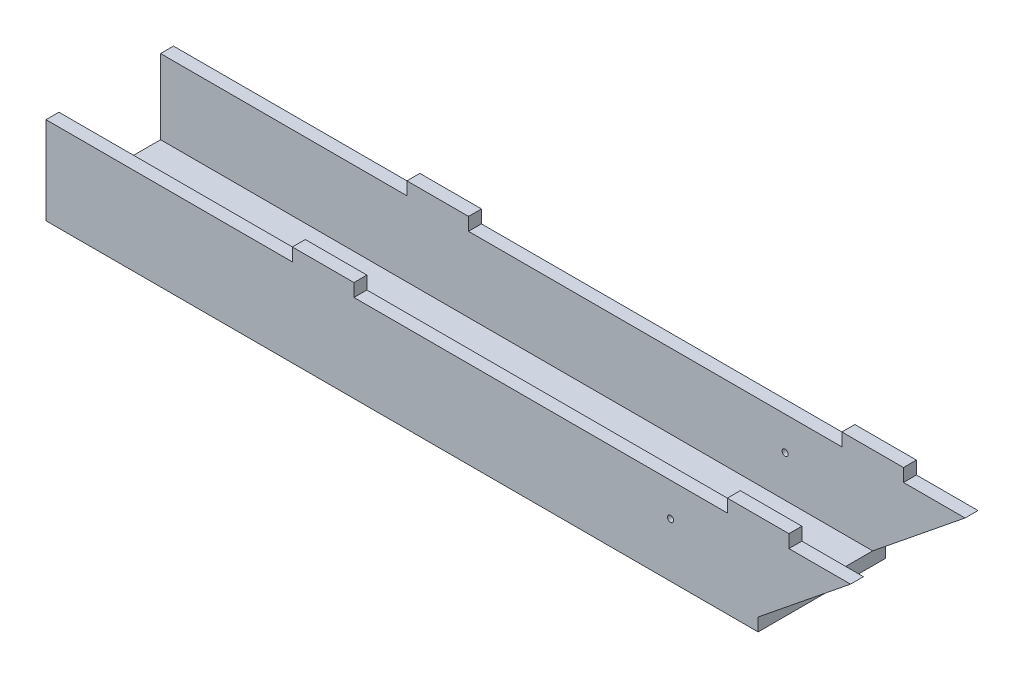
ISO-10303-21;
HEADER;
FILE_DESCRIPTION(('STEP AP214'),'2;1');
FILE_NAME('part.step','',(''),(''),'','','');
FILE_SCHEMA(('AUTOMOTIVE_DESIGN { 1 0 10303 214 1 1 1 1 }'));
ENDSEC;
DATA;
#1=APPLICATION_CONTEXT('core data for automotive mechanical design processes');
#2=APPLICATION_PROTOCOL_DEFINITION('international standard','automotive_design',2000,#1);
#3=PRODUCT_CONTEXT('',#1,'mechanical');
#4=PRODUCT('Part','Part','',(#3));
#5=PRODUCT_RELATED_PRODUCT_CATEGORY('part','',(#4));
#6=PRODUCT_DEFINITION_FORMATION('','',#4);
#7=PRODUCT_DEFINITION_CONTEXT('part definition',#1,'design');
#8=PRODUCT_DEFINITION('design','',#6,#7);
#9=PRODUCT_DEFINITION_SHAPE('','',#8);
#10=(LENGTH_UNIT() NAMED_UNIT(*) SI_UNIT(.MILLI.,.METRE.));
#11=(NAMED_UNIT(*) PLANE_ANGLE_UNIT() SI_UNIT($,.RADIAN.));
#12=(NAMED_UNIT(*) SI_UNIT($,.STERADIAN.) SOLID_ANGLE_UNIT());
#13=UNCERTAINTY_MEASURE_WITH_UNIT(LENGTH_MEASURE(1.E-05),#10,'distance_accuracy_value','');
#14=(GEOMETRIC_REPRESENTATION_CONTEXT(3) GLOBAL_UNCERTAINTY_ASSIGNED_CONTEXT((#13)) GLOBAL_UNIT_ASSIGNED_CONTEXT((#10,
#11,#12)) REPRESENTATION_CONTEXT('',''));
#15=CARTESIAN_POINT('',(0.,0.,0.));
#16=DIRECTION('',(0.,0.,1.));
#17=DIRECTION('',(1.,0.,0.));
#18=AXIS2_PLACEMENT_3D('',#15,#16,#17);
#19=CARTESIAN_POINT('',(0.,5.334,0.));
#20=DIRECTION('',(0.,-1.,0.));
#21=DIRECTION('',(0.,0.,-1.));
#22=AXIS2_PLACEMENT_3D('',#19,#20,#21);
#23=PLANE('',#22);
#24=DIRECTION('',(-1.,0.,0.));
#25=VECTOR('',#24,1.);
#26=CARTESIAN_POINT('',(0.,5.334,-20.955));
#27=LINE('',#26,#25);
#28=CARTESIAN_POINT('',(146.84375,5.334,-20.955));
#29=VERTEX_POINT('',#28);
#30=CARTESIAN_POINT('',(-146.84375,5.334,-20.955));
#31=VERTEX_POINT('',#30);
#32=EDGE_CURVE('E219',#29,#31,#27,.T.);
#33=ORIENTED_EDGE('',*,*,#32,.T.);
#34=DIRECTION('',(0.,0.,1.));
#35=VECTOR('',#34,1.);
#36=CARTESIAN_POINT('',(-146.84375,5.334,26.289));
#37=LINE('',#36,#35);
#38=CARTESIAN_POINT('',(-146.84375,5.334,20.955));
#39=VERTEX_POINT('',#38);
#40=EDGE_CURVE('E207',#31,#39,#37,.T.);
#41=ORIENTED_EDGE('',*,*,#40,.T.);
#42=DIRECTION('',(-1.,0.,0.));
#43=VECTOR('',#42,1.);
#44=CARTESIAN_POINT('',(0.,5.334,20.955));
#45=LINE('',#44,#43);
#46=CARTESIAN_POINT('',(146.84375,5.334,20.955));
#47=VERTEX_POINT('',#46);
#48=EDGE_CURVE('E62',#47,#39,#45,.T.);
#49=ORIENTED_EDGE('',*,*,#48,.F.);
#50=DIRECTION('',(0.,0.,-1.));
#51=VECTOR('',#50,1.);
#52=CARTESIAN_POINT('',(146.84375,5.334,26.289));
#53=LINE('',#52,#51);
#54=EDGE_CURVE('E220',#47,#29,#53,.T.);
#55=ORIENTED_EDGE('',*,*,#54,.T.);
#56=EDGE_LOOP('',(#33,#41,#49,#55));
#57=FACE_BOUND('',#56,.T.);
#58=ADVANCED_FACE('F39',(#57),#23,.F.);
#59=CARTESIAN_POINT('',(146.84375,5.334,26.289));
#60=DIRECTION('',(-1.,0.,0.));
#61=DIRECTION('',(0.,0.,1.));
#62=AXIS2_PLACEMENT_3D('',#59,#60,#61);
#63=PLANE('',#62);
#64=DIRECTION('',(0.,0.,-1.));
#65=VECTOR('',#64,1.);
#66=CARTESIAN_POINT('',(146.84375,0.,26.289));
#67=LINE('',#66,#65);
#68=CARTESIAN_POINT('',(146.84375,0.,26.289));
#69=VERTEX_POINT('',#68);
#70=CARTESIAN_POINT('',(146.84375,0.,-26.289));
#71=VERTEX_POINT('',#70);
#72=EDGE_CURVE('E352',#69,#71,#67,.T.);
#73=ORIENTED_EDGE('',*,*,#72,.T.);
#74=DIRECTION('',(0.,-1.,0.));
#75=VECTOR('',#74,1.);
#76=CARTESIAN_POINT('',(146.84375,5.334,-26.289));
#77=LINE('',#76,#75);
#78=CARTESIAN_POINT('',(146.84375,5.334,-26.289));
#79=VERTEX_POINT('',#78);
#80=EDGE_CURVE('E11',#79,#71,#77,.T.);
#81=ORIENTED_EDGE('',*,*,#80,.F.);
#82=DIRECTION('',(0.,0.,-1.));
#83=VECTOR('',#82,1.);
#84=CARTESIAN_POINT('',(146.84375,5.334,-20.955));
#85=LINE('',#84,#83);
#86=EDGE_CURVE('E55',#29,#79,#85,.T.);
#87=ORIENTED_EDGE('',*,*,#86,.F.);
#88=ORIENTED_EDGE('',*,*,#54,.F.);
#89=CARTESIAN_POINT('',(146.84375,5.334,26.289));
#90=VERTEX_POINT('',#89);
#91=EDGE_CURVE('E216',#90,#47,#53,.T.);
#92=ORIENTED_EDGE('',*,*,#91,.F.);
#93=DIRECTION('',(0.,-1.,0.));
#94=VECTOR('',#93,1.);
#95=CARTESIAN_POINT('',(146.84375,5.334,26.289));
#96=LINE('',#95,#94);
#97=EDGE_CURVE('E215',#90,#69,#96,.T.);
#98=ORIENTED_EDGE('',*,*,#97,.T.);
#99=EDGE_LOOP('',(#73,#81,#87,#88,#92,#98));
#100=FACE_BOUND('',#99,.T.);
#101=ADVANCED_FACE('F41',(#100),#63,.F.);
#102=CARTESIAN_POINT('',(-146.84375,5.334,-26.289));
#103=DIRECTION('',(0.,0.,1.));
#104=DIRECTION('',(1.,0.,0.));
#105=AXIS2_PLACEMENT_3D('',#102,#103,#104);
#106=PLANE('',#105);
#107=CARTESIAN_POINT('',(110.744734300846,22.3424124837105,-26.289));
#108=DIRECTION('',(0.,0.,1.));
#109=DIRECTION('',(1.,0.,0.));
#110=AXIS2_PLACEMENT_3D('',#107,#108,#109);
#111=CIRCLE('',#110,1.26999999999999);
#112=CARTESIAN_POINT('',(112.014734300846,22.3424124837105,-26.289));
#113=VERTEX_POINT('',#112);
#114=EDGE_CURVE('E480',#113,#113,#111,.T.);
#115=ORIENTED_EDGE('',*,*,#114,.T.);
#116=EDGE_LOOP('',(#115));
#117=FACE_BOUND('',#116,.T.);
#118=DIRECTION('',(-1.,0.,0.));
#119=VECTOR('',#118,1.);
#120=CARTESIAN_POINT('',(-146.84375,0.,-26.289));
#121=LINE('',#120,#119);
#122=CARTESIAN_POINT('',(-146.84375,0.,-26.289));
#123=VERTEX_POINT('',#122);
#124=EDGE_CURVE('E378',#71,#123,#121,.T.);
#125=ORIENTED_EDGE('',*,*,#124,.T.);
#126=DIRECTION('',(0.,-1.,0.));
#127=VECTOR('',#126,1.);
#128=CARTESIAN_POINT('',(-146.84375,5.334,-26.289));
#129=LINE('',#128,#127);
#130=CARTESIAN_POINT('',(-146.84375,36.1188,-26.289));
#131=VERTEX_POINT('',#130);
#132=EDGE_CURVE('E48',#131,#123,#129,.T.);
#133=ORIENTED_EDGE('',*,*,#132,.F.);
#134=DIRECTION('',(1.,0.,0.));
#135=VECTOR('',#134,1.);
#136=CARTESIAN_POINT('',(0.,36.1188,-26.289));
#137=LINE('',#136,#135);
#138=CARTESIAN_POINT('',(-45.24375,36.1188,-26.289));
#139=VERTEX_POINT('',#138);
#140=EDGE_CURVE('E255',#131,#139,#137,.T.);
#141=ORIENTED_EDGE('',*,*,#140,.T.);
#142=DIRECTION('',(0.,1.,0.));
#143=VECTOR('',#142,1.);
#144=CARTESIAN_POINT('',(-45.24375,0.,-26.289));
#145=LINE('',#144,#143);
#146=CARTESIAN_POINT('',(-45.24375,41.4528,-26.289));
#147=VERTEX_POINT('',#146);
#148=EDGE_CURVE('E259',#139,#147,#145,.T.);
#149=ORIENTED_EDGE('',*,*,#148,.T.);
#150=DIRECTION('',(1.,0.,0.));
#151=VECTOR('',#150,1.);
#152=CARTESIAN_POINT('',(0.,41.4528,-26.289));
#153=LINE('',#152,#151);
#154=CARTESIAN_POINT('',(-19.84375,41.4528,-26.289));
#155=VERTEX_POINT('',#154);
#156=EDGE_CURVE('E264',#147,#155,#153,.T.);
#157=ORIENTED_EDGE('',*,*,#156,.T.);
#158=DIRECTION('',(0.,1.,0.));
#159=VECTOR('',#158,1.);
#160=CARTESIAN_POINT('',(-19.84375,0.,-26.289));
#161=LINE('',#160,#159);
#162=CARTESIAN_POINT('',(-19.84375,36.1188,-26.289));
#163=VERTEX_POINT('',#162);
#164=EDGE_CURVE('E267',#163,#155,#161,.T.);
#165=ORIENTED_EDGE('',*,*,#164,.F.);
#166=CARTESIAN_POINT('',(134.14375,36.1188,-26.289));
#167=VERTEX_POINT('',#166);
#168=EDGE_CURVE('E261',#163,#167,#137,.T.);
#169=ORIENTED_EDGE('',*,*,#168,.T.);
#170=DIRECTION('',(0.,1.,0.));
#171=VECTOR('',#170,1.);
#172=CARTESIAN_POINT('',(134.14375,0.,-26.289));
#173=LINE('',#172,#171);
#174=CARTESIAN_POINT('',(134.14375,41.4528,-26.289));
#175=VERTEX_POINT('',#174);
#176=EDGE_CURVE('E270',#167,#175,#173,.T.);
#177=ORIENTED_EDGE('',*,*,#176,.T.);
#178=DIRECTION('',(-1.,0.,0.));
#179=VECTOR('',#178,1.);
#180=CARTESIAN_POINT('',(0.,41.4528,-26.289));
#181=LINE('',#180,#179);
#182=CARTESIAN_POINT('',(159.54375,41.4528,-26.289));
#183=VERTEX_POINT('',#182);
#184=EDGE_CURVE('E273',#183,#175,#181,.T.);
#185=ORIENTED_EDGE('',*,*,#184,.F.);
#186=DIRECTION('',(0.,1.,0.));
#187=VECTOR('',#186,1.);
#188=CARTESIAN_POINT('',(159.54375,0.,-26.289));
#189=LINE('',#188,#187);
#190=CARTESIAN_POINT('',(159.54375,36.1188,-26.289));
#191=VERTEX_POINT('',#190);
#192=EDGE_CURVE('E276',#191,#183,#189,.T.);
#193=ORIENTED_EDGE('',*,*,#192,.F.);
#194=CARTESIAN_POINT('',(184.94375,36.1188,-26.289));
#195=VERTEX_POINT('',#194);
#196=EDGE_CURVE('E260',#191,#195,#137,.T.);
#197=ORIENTED_EDGE('',*,*,#196,.T.);
#198=DIRECTION('',(-0.777824179735148,-0.628481937225999,0.));
#199=VECTOR('',#198,1.);
#200=CARTESIAN_POINT('',(55.3942284422675,-68.5572134186479,-26.289));
#201=LINE('',#200,#199);
#202=EDGE_CURVE('E252',#195,#79,#201,.T.);
#203=ORIENTED_EDGE('',*,*,#202,.T.);
#204=ORIENTED_EDGE('',*,*,#80,.T.);
#205=EDGE_LOOP('',(#125,#133,#141,#149,#157,#165,#169,#177,#185,#193,#197,#203,#204));
#206=FACE_BOUND('',#205,.T.);
#207=ADVANCED_FACE('F465',(#117,#206),#106,.F.);
#208=CARTESIAN_POINT('',(-146.84375,5.334,26.289));
#209=DIRECTION('',(1.,0.,0.));
#210=DIRECTION('',(0.,0.,-1.));
#211=AXIS2_PLACEMENT_3D('',#208,#209,#210);
#212=PLANE('',#211);
#213=DIRECTION('',(0.,0.,1.));
#214=VECTOR('',#213,1.);
#215=CARTESIAN_POINT('',(-146.84375,0.,26.289));
#216=LINE('',#215,#214);
#217=CARTESIAN_POINT('',(-146.84375,0.,26.289));
#218=VERTEX_POINT('',#217);
#219=EDGE_CURVE('E380',#123,#218,#216,.T.);
#220=ORIENTED_EDGE('',*,*,#219,.T.);
#221=DIRECTION('',(0.,-1.,0.));
#222=VECTOR('',#221,1.);
#223=CARTESIAN_POINT('',(-146.84375,5.334,26.289));
#224=LINE('',#223,#222);
#225=CARTESIAN_POINT('',(-146.84375,36.1188,26.289));
#226=VERTEX_POINT('',#225);
#227=EDGE_CURVE('E386',#226,#218,#224,.T.);
#228=ORIENTED_EDGE('',*,*,#227,.F.);
#229=DIRECTION('',(0.,0.,1.));
#230=VECTOR('',#229,1.);
#231=CARTESIAN_POINT('',(-146.84375,36.1188,20.955));
#232=LINE('',#231,#230);
#233=CARTESIAN_POINT('',(-146.84375,36.1188,20.955));
#234=VERTEX_POINT('',#233);
#235=EDGE_CURVE('E349',#234,#226,#232,.T.);
#236=ORIENTED_EDGE('',*,*,#235,.F.);
#237=DIRECTION('',(0.,1.,0.));
#238=VECTOR('',#237,1.);
#239=CARTESIAN_POINT('',(-146.84375,0.,20.955));
#240=LINE('',#239,#238);
#241=EDGE_CURVE('E214',#39,#234,#240,.T.);
#242=ORIENTED_EDGE('',*,*,#241,.F.);
#243=ORIENTED_EDGE('',*,*,#40,.F.);
#244=DIRECTION('',(0.,1.,0.));
#245=VECTOR('',#244,1.);
#246=CARTESIAN_POINT('',(-146.84375,0.,-20.955));
#247=LINE('',#246,#245);
#248=CARTESIAN_POINT('',(-146.84375,36.1188,-20.955));
#249=VERTEX_POINT('',#248);
#250=EDGE_CURVE('E212',#31,#249,#247,.T.);
#251=ORIENTED_EDGE('',*,*,#250,.T.);
#252=DIRECTION('',(0.,0.,-1.));
#253=VECTOR('',#252,1.);
#254=CARTESIAN_POINT('',(-146.84375,36.1188,-20.955));
#255=LINE('',#254,#253);
#256=EDGE_CURVE('E298',#249,#131,#255,.T.);
#257=ORIENTED_EDGE('',*,*,#256,.T.);
#258=ORIENTED_EDGE('',*,*,#132,.T.);
#259=EDGE_LOOP('',(#220,#228,#236,#242,#243,#251,#257,#258));
#260=FACE_BOUND('',#259,.T.);
#261=ADVANCED_FACE('F209',(#260),#212,.F.);
#262=CARTESIAN_POINT('',(-146.84375,5.334,26.289));
#263=DIRECTION('',(0.,0.,-1.));
#264=DIRECTION('',(-1.,0.,0.));
#265=AXIS2_PLACEMENT_3D('',#262,#263,#264);
#266=PLANE('',#265);
#267=CARTESIAN_POINT('',(110.744734300846,22.3424124837105,26.289));
#268=DIRECTION('',(0.,0.,1.));
#269=DIRECTION('',(1.,0.,0.));
#270=AXIS2_PLACEMENT_3D('',#267,#268,#269);
#271=CIRCLE('',#270,1.26999999999999);
#272=CARTESIAN_POINT('',(112.014734300846,22.3424124837105,26.289));
#273=VERTEX_POINT('',#272);
#274=EDGE_CURVE('E489',#273,#273,#271,.T.);
#275=ORIENTED_EDGE('',*,*,#274,.F.);
#276=EDGE_LOOP('',(#275));
#277=FACE_BOUND('',#276,.T.);
#278=DIRECTION('',(1.,0.,0.));
#279=VECTOR('',#278,1.);
#280=CARTESIAN_POINT('',(-146.84375,0.,26.289));
#281=LINE('',#280,#279);
#282=EDGE_CURVE('E382',#218,#69,#281,.T.);
#283=ORIENTED_EDGE('',*,*,#282,.T.);
#284=ORIENTED_EDGE('',*,*,#97,.F.);
#285=DIRECTION('',(-0.777824179735148,-0.628481937225999,0.));
#286=VECTOR('',#285,1.);
#287=CARTESIAN_POINT('',(55.3942284422675,-68.5572134186479,26.289));
#288=LINE('',#287,#286);
#289=CARTESIAN_POINT('',(184.94375,36.1188,26.289));
#290=VERTEX_POINT('',#289);
#291=EDGE_CURVE('E280',#290,#90,#288,.T.);
#292=ORIENTED_EDGE('',*,*,#291,.F.);
#293=DIRECTION('',(1.,0.,0.));
#294=VECTOR('',#293,1.);
#295=CARTESIAN_POINT('',(0.,36.1188,26.289));
#296=LINE('',#295,#294);
#297=CARTESIAN_POINT('',(159.54375,36.1188,26.289));
#298=VERTEX_POINT('',#297);
#299=EDGE_CURVE('E329',#298,#290,#296,.T.);
#300=ORIENTED_EDGE('',*,*,#299,.F.);
#301=DIRECTION('',(0.,1.,0.));
#302=VECTOR('',#301,1.);
#303=CARTESIAN_POINT('',(159.54375,0.,26.289));
#304=LINE('',#303,#302);
#305=CARTESIAN_POINT('',(159.54375,41.4528,26.289));
#306=VERTEX_POINT('',#305);
#307=EDGE_CURVE('E331',#298,#306,#304,.T.);
#308=ORIENTED_EDGE('',*,*,#307,.T.);
#309=DIRECTION('',(-1.,0.,0.));
#310=VECTOR('',#309,1.);
#311=CARTESIAN_POINT('',(0.,41.4528,26.289));
#312=LINE('',#311,#310);
#313=CARTESIAN_POINT('',(134.14375,41.4528,26.289));
#314=VERTEX_POINT('',#313);
#315=EDGE_CURVE('E335',#306,#314,#312,.T.);
#316=ORIENTED_EDGE('',*,*,#315,.T.);
#317=DIRECTION('',(0.,1.,0.));
#318=VECTOR('',#317,1.);
#319=CARTESIAN_POINT('',(134.14375,0.,26.289));
#320=LINE('',#319,#318);
#321=CARTESIAN_POINT('',(134.14375,36.1188,26.289));
#322=VERTEX_POINT('',#321);
#323=EDGE_CURVE('E338',#322,#314,#320,.T.);
#324=ORIENTED_EDGE('',*,*,#323,.F.);
#325=CARTESIAN_POINT('',(-19.84375,36.1188,26.289));
#326=VERTEX_POINT('',#325);
#327=EDGE_CURVE('E332',#326,#322,#296,.T.);
#328=ORIENTED_EDGE('',*,*,#327,.F.);
#329=DIRECTION('',(0.,1.,0.));
#330=VECTOR('',#329,1.);
#331=CARTESIAN_POINT('',(-19.84375,0.,26.289));
#332=LINE('',#331,#330);
#333=CARTESIAN_POINT('',(-19.84375,41.4528,26.289));
#334=VERTEX_POINT('',#333);
#335=EDGE_CURVE('E341',#326,#334,#332,.T.);
#336=ORIENTED_EDGE('',*,*,#335,.T.);
#337=DIRECTION('',(1.,0.,0.));
#338=VECTOR('',#337,1.);
#339=CARTESIAN_POINT('',(0.,41.4528,26.289));
#340=LINE('',#339,#338);
#341=CARTESIAN_POINT('',(-45.24375,41.4528,26.289));
#342=VERTEX_POINT('',#341);
#343=EDGE_CURVE('E344',#342,#334,#340,.T.);
#344=ORIENTED_EDGE('',*,*,#343,.F.);
#345=DIRECTION('',(0.,1.,0.));
#346=VECTOR('',#345,1.);
#347=CARTESIAN_POINT('',(-45.24375,0.,26.289));
#348=LINE('',#347,#346);
#349=CARTESIAN_POINT('',(-45.24375,36.1188,26.289));
#350=VERTEX_POINT('',#349);
#351=EDGE_CURVE('E347',#350,#342,#348,.T.);
#352=ORIENTED_EDGE('',*,*,#351,.F.);
#353=EDGE_CURVE('E305',#226,#350,#296,.T.);
#354=ORIENTED_EDGE('',*,*,#353,.F.);
#355=ORIENTED_EDGE('',*,*,#227,.T.);
#356=EDGE_LOOP('',(#283,#284,#292,#300,#308,#316,#324,#328,#336,#344,#352,#354,#355));
#357=FACE_BOUND('',#356,.T.);
#358=ADVANCED_FACE('F398',(#277,#357),#266,.F.);
#359=CARTESIAN_POINT('',(0.,0.,0.));
#360=DIRECTION('',(0.,-1.,0.));
#361=DIRECTION('',(0.,0.,-1.));
#362=AXIS2_PLACEMENT_3D('',#359,#360,#361);
#363=PLANE('',#362);
#364=ORIENTED_EDGE('',*,*,#72,.F.);
#365=ORIENTED_EDGE('',*,*,#282,.F.);
#366=ORIENTED_EDGE('',*,*,#219,.F.);
#367=ORIENTED_EDGE('',*,*,#124,.F.);
#368=EDGE_LOOP('',(#364,#365,#366,#367));
#369=FACE_BOUND('',#368,.T.);
#370=ADVANCED_FACE('F396',(#369),#363,.T.);
#371=CARTESIAN_POINT('',(55.3942284422675,-68.5572134186479,20.955));
#372=DIRECTION('',(-0.628481937225999,0.777824179735148,0.));
#373=DIRECTION('',(-0.777824179735148,-0.628481937225999,0.));
#374=AXIS2_PLACEMENT_3D('',#371,#372,#373);
#375=PLANE('',#374);
#376=ORIENTED_EDGE('',*,*,#291,.T.);
#377=ORIENTED_EDGE('',*,*,#91,.T.);
#378=DIRECTION('',(-0.777824179735148,-0.628481937225999,0.));
#379=VECTOR('',#378,1.);
#380=CARTESIAN_POINT('',(55.3942284422675,-68.5572134186479,20.955));
#381=LINE('',#380,#379);
#382=CARTESIAN_POINT('',(184.94375,36.1188,20.955));
#383=VERTEX_POINT('',#382);
#384=EDGE_CURVE('E301',#383,#47,#381,.T.);
#385=ORIENTED_EDGE('',*,*,#384,.F.);
#386=DIRECTION('',(0.,0.,1.));
#387=VECTOR('',#386,1.);
#388=CARTESIAN_POINT('',(184.94375,36.1188,20.955));
#389=LINE('',#388,#387);
#390=EDGE_CURVE('E326',#383,#290,#389,.T.);
#391=ORIENTED_EDGE('',*,*,#390,.T.);
#392=EDGE_LOOP('',(#376,#377,#385,#391));
#393=FACE_BOUND('',#392,.T.);
#394=ADVANCED_FACE('F404',(#393),#375,.F.);
#395=CARTESIAN_POINT('',(0.,36.1188,20.955));
#396=DIRECTION('',(0.,-1.,0.));
#397=DIRECTION('',(0.,0.,-1.));
#398=AXIS2_PLACEMENT_3D('',#395,#396,#397);
#399=PLANE('',#398);
#400=ORIENTED_EDGE('',*,*,#353,.T.);
#401=DIRECTION('',(0.,0.,1.));
#402=VECTOR('',#401,1.);
#403=CARTESIAN_POINT('',(-45.24375,36.1188,20.955));
#404=LINE('',#403,#402);
#405=CARTESIAN_POINT('',(-45.24375,36.1188,20.955));
#406=VERTEX_POINT('',#405);
#407=EDGE_CURVE('E353',#406,#350,#404,.T.);
#408=ORIENTED_EDGE('',*,*,#407,.F.);
#409=DIRECTION('',(1.,0.,0.));
#410=VECTOR('',#409,1.);
#411=CARTESIAN_POINT('',(0.,36.1188,20.955));
#412=LINE('',#411,#410);
#413=EDGE_CURVE('E308',#234,#406,#412,.T.);
#414=ORIENTED_EDGE('',*,*,#413,.F.);
#415=ORIENTED_EDGE('',*,*,#235,.T.);
#416=EDGE_LOOP('',(#400,#408,#414,#415));
#417=FACE_BOUND('',#416,.T.);
#418=ADVANCED_FACE('F431',(#417),#399,.F.);
#419=CARTESIAN_POINT('',(-45.24375,0.,20.955));
#420=DIRECTION('',(1.,0.,0.));
#421=DIRECTION('',(0.,0.,-1.));
#422=AXIS2_PLACEMENT_3D('',#419,#420,#421);
#423=PLANE('',#422);
#424=ORIENTED_EDGE('',*,*,#351,.T.);
#425=DIRECTION('',(0.,0.,1.));
#426=VECTOR('',#425,1.);
#427=CARTESIAN_POINT('',(-45.24375,41.4528,20.955));
#428=LINE('',#427,#426);
#429=CARTESIAN_POINT('',(-45.24375,41.4528,20.955));
#430=VERTEX_POINT('',#429);
#431=EDGE_CURVE('E356',#430,#342,#428,.T.);
#432=ORIENTED_EDGE('',*,*,#431,.F.);
#433=DIRECTION('',(0.,1.,0.));
#434=VECTOR('',#433,1.);
#435=CARTESIAN_POINT('',(-45.24375,0.,20.955));
#436=LINE('',#435,#434);
#437=EDGE_CURVE('E322',#406,#430,#436,.T.);
#438=ORIENTED_EDGE('',*,*,#437,.F.);
#439=ORIENTED_EDGE('',*,*,#407,.T.);
#440=EDGE_LOOP('',(#424,#432,#438,#439));
#441=FACE_BOUND('',#440,.T.);
#442=ADVANCED_FACE('F436',(#441),#423,.F.);
#443=CARTESIAN_POINT('',(0.,41.4528,20.955));
#444=DIRECTION('',(0.,-1.,0.));
#445=DIRECTION('',(0.,0.,-1.));
#446=AXIS2_PLACEMENT_3D('',#443,#444,#445);
#447=PLANE('',#446);
#448=ORIENTED_EDGE('',*,*,#343,.T.);
#449=DIRECTION('',(0.,0.,1.));
#450=VECTOR('',#449,1.);
#451=CARTESIAN_POINT('',(-19.84375,41.4528,20.955));
#452=LINE('',#451,#450);
#453=CARTESIAN_POINT('',(-19.84375,41.4528,20.955));
#454=VERTEX_POINT('',#453);
#455=EDGE_CURVE('E359',#454,#334,#452,.T.);
#456=ORIENTED_EDGE('',*,*,#455,.F.);
#457=DIRECTION('',(1.,0.,0.));
#458=VECTOR('',#457,1.);
#459=CARTESIAN_POINT('',(0.,41.4528,20.955));
#460=LINE('',#459,#458);
#461=EDGE_CURVE('E320',#430,#454,#460,.T.);
#462=ORIENTED_EDGE('',*,*,#461,.F.);
#463=ORIENTED_EDGE('',*,*,#431,.T.);
#464=EDGE_LOOP('',(#448,#456,#462,#463));
#465=FACE_BOUND('',#464,.T.);
#466=ADVANCED_FACE('F441',(#465),#447,.F.);
#467=CARTESIAN_POINT('',(-19.84375,0.,20.955));
#468=DIRECTION('',(1.,0.,0.));
#469=DIRECTION('',(0.,0.,-1.));
#470=AXIS2_PLACEMENT_3D('',#467,#468,#469);
#471=PLANE('',#470);
#472=ORIENTED_EDGE('',*,*,#335,.F.);
#473=DIRECTION('',(0.,0.,1.));
#474=VECTOR('',#473,1.);
#475=CARTESIAN_POINT('',(-19.84375,36.1188,20.955));
#476=LINE('',#475,#474);
#477=CARTESIAN_POINT('',(-19.84375,36.1188,20.955));
#478=VERTEX_POINT('',#477);
#479=EDGE_CURVE('E361',#478,#326,#476,.T.);
#480=ORIENTED_EDGE('',*,*,#479,.F.);
#481=DIRECTION('',(0.,1.,0.));
#482=VECTOR('',#481,1.);
#483=CARTESIAN_POINT('',(-19.84375,0.,20.955));
#484=LINE('',#483,#482);
#485=EDGE_CURVE('E317',#478,#454,#484,.T.);
#486=ORIENTED_EDGE('',*,*,#485,.T.);
#487=ORIENTED_EDGE('',*,*,#455,.T.);
#488=EDGE_LOOP('',(#472,#480,#486,#487));
#489=FACE_BOUND('',#488,.T.);
#490=ADVANCED_FACE('F458',(#489),#471,.T.);
#491=ORIENTED_EDGE('',*,*,#327,.T.);
#492=DIRECTION('',(0.,0.,1.));
#493=VECTOR('',#492,1.);
#494=CARTESIAN_POINT('',(134.14375,36.1188,20.955));
#495=LINE('',#494,#493);
#496=CARTESIAN_POINT('',(134.14375,36.1188,20.955));
#497=VERTEX_POINT('',#496);
#498=EDGE_CURVE('E363',#497,#322,#495,.T.);
#499=ORIENTED_EDGE('',*,*,#498,.F.);
#500=EDGE_CURVE('E309',#478,#497,#412,.T.);
#501=ORIENTED_EDGE('',*,*,#500,.F.);
#502=ORIENTED_EDGE('',*,*,#479,.T.);
#503=EDGE_LOOP('',(#491,#499,#501,#502));
#504=FACE_BOUND('',#503,.T.);
#505=ADVANCED_FACE('F427',(#504),#399,.F.);
#506=CARTESIAN_POINT('',(134.14375,0.,20.955));
#507=DIRECTION('',(1.,0.,0.));
#508=DIRECTION('',(0.,0.,-1.));
#509=AXIS2_PLACEMENT_3D('',#506,#507,#508);
#510=PLANE('',#509);
#511=ORIENTED_EDGE('',*,*,#323,.T.);
#512=DIRECTION('',(0.,0.,1.));
#513=VECTOR('',#512,1.);
#514=CARTESIAN_POINT('',(134.14375,41.4528,20.955));
#515=LINE('',#514,#513);
#516=CARTESIAN_POINT('',(134.14375,41.4528,20.955));
#517=VERTEX_POINT('',#516);
#518=EDGE_CURVE('E366',#517,#314,#515,.T.);
#519=ORIENTED_EDGE('',*,*,#518,.F.);
#520=DIRECTION('',(0.,1.,0.));
#521=VECTOR('',#520,1.);
#522=CARTESIAN_POINT('',(134.14375,0.,20.955));
#523=LINE('',#522,#521);
#524=EDGE_CURVE('E315',#497,#517,#523,.T.);
#525=ORIENTED_EDGE('',*,*,#524,.F.);
#526=ORIENTED_EDGE('',*,*,#498,.T.);
#527=EDGE_LOOP('',(#511,#519,#525,#526));
#528=FACE_BOUND('',#527,.T.);
#529=ADVANCED_FACE('F422',(#528),#510,.F.);
#530=CARTESIAN_POINT('',(0.,41.4528,20.955));
#531=DIRECTION('',(0.,1.,0.));
#532=DIRECTION('',(0.,0.,1.));
#533=AXIS2_PLACEMENT_3D('',#530,#531,#532);
#534=PLANE('',#533);
#535=ORIENTED_EDGE('',*,*,#315,.F.);
#536=DIRECTION('',(0.,0.,1.));
#537=VECTOR('',#536,1.);
#538=CARTESIAN_POINT('',(159.54375,41.4528,20.955));
#539=LINE('',#538,#537);
#540=CARTESIAN_POINT('',(159.54375,41.4528,20.955));
#541=VERTEX_POINT('',#540);
#542=EDGE_CURVE('E368',#541,#306,#539,.T.);
#543=ORIENTED_EDGE('',*,*,#542,.F.);
#544=DIRECTION('',(-1.,0.,0.));
#545=VECTOR('',#544,1.);
#546=CARTESIAN_POINT('',(0.,41.4528,20.955));
#547=LINE('',#546,#545);
#548=EDGE_CURVE('E312',#541,#517,#547,.T.);
#549=ORIENTED_EDGE('',*,*,#548,.T.);
#550=ORIENTED_EDGE('',*,*,#518,.T.);
#551=EDGE_LOOP('',(#535,#543,#549,#550));
#552=FACE_BOUND('',#551,.T.);
#553=ADVANCED_FACE('F416',(#552),#534,.T.);
#554=CARTESIAN_POINT('',(159.54375,0.,20.955));
#555=DIRECTION('',(1.,0.,0.));
#556=DIRECTION('',(0.,0.,-1.));
#557=AXIS2_PLACEMENT_3D('',#554,#555,#556);
#558=PLANE('',#557);
#559=ORIENTED_EDGE('',*,*,#307,.F.);
#560=DIRECTION('',(0.,0.,1.));
#561=VECTOR('',#560,1.);
#562=CARTESIAN_POINT('',(159.54375,36.1188,20.955));
#563=LINE('',#562,#561);
#564=CARTESIAN_POINT('',(159.54375,36.1188,20.955));
#565=VERTEX_POINT('',#564);
#566=EDGE_CURVE('E370',#565,#298,#563,.T.);
#567=ORIENTED_EDGE('',*,*,#566,.F.);
#568=DIRECTION('',(0.,1.,0.));
#569=VECTOR('',#568,1.);
#570=CARTESIAN_POINT('',(159.54375,0.,20.955));
#571=LINE('',#570,#569);
#572=EDGE_CURVE('E307',#565,#541,#571,.T.);
#573=ORIENTED_EDGE('',*,*,#572,.T.);
#574=ORIENTED_EDGE('',*,*,#542,.T.);
#575=EDGE_LOOP('',(#559,#567,#573,#574));
#576=FACE_BOUND('',#575,.T.);
#577=ADVANCED_FACE('F410',(#576),#558,.T.);
#578=ORIENTED_EDGE('',*,*,#299,.T.);
#579=ORIENTED_EDGE('',*,*,#390,.F.);
#580=EDGE_CURVE('E304',#565,#383,#412,.T.);
#581=ORIENTED_EDGE('',*,*,#580,.F.);
#582=ORIENTED_EDGE('',*,*,#566,.T.);
#583=EDGE_LOOP('',(#578,#579,#581,#582));
#584=FACE_BOUND('',#583,.T.);
#585=ADVANCED_FACE('F445',(#584),#399,.F.);
#586=CARTESIAN_POINT('',(0.,0.,20.955));
#587=DIRECTION('',(0.,0.,1.));
#588=DIRECTION('',(1.,0.,0.));
#589=AXIS2_PLACEMENT_3D('',#586,#587,#588);
#590=PLANE('',#589);
#591=CARTESIAN_POINT('',(110.744734300846,22.3424124837105,20.955));
#592=DIRECTION('',(0.,0.,1.));
#593=DIRECTION('',(1.,0.,0.));
#594=AXIS2_PLACEMENT_3D('',#591,#592,#593);
#595=CIRCLE('',#594,1.26999999999999);
#596=CARTESIAN_POINT('',(112.014734300846,22.3424124837105,20.955));
#597=VERTEX_POINT('',#596);
#598=EDGE_CURVE('E256',#597,#597,#595,.T.);
#599=ORIENTED_EDGE('',*,*,#598,.T.);
#600=EDGE_LOOP('',(#599));
#601=FACE_BOUND('',#600,.T.);
#602=ORIENTED_EDGE('',*,*,#384,.T.);
#603=ORIENTED_EDGE('',*,*,#48,.T.);
#604=ORIENTED_EDGE('',*,*,#241,.T.);
#605=ORIENTED_EDGE('',*,*,#413,.T.);
#606=ORIENTED_EDGE('',*,*,#437,.T.);
#607=ORIENTED_EDGE('',*,*,#461,.T.);
#608=ORIENTED_EDGE('',*,*,#485,.F.);
#609=ORIENTED_EDGE('',*,*,#500,.T.);
#610=ORIENTED_EDGE('',*,*,#524,.T.);
#611=ORIENTED_EDGE('',*,*,#548,.F.);
#612=ORIENTED_EDGE('',*,*,#572,.F.);
#613=ORIENTED_EDGE('',*,*,#580,.T.);
#614=EDGE_LOOP('',(#602,#603,#604,#605,#606,#607,#608,#609,#610,#611,#612,#613));
#615=FACE_BOUND('',#614,.T.);
#616=ADVANCED_FACE('F444',(#601,#615),#590,.F.);
#617=CARTESIAN_POINT('',(55.3942284422675,-68.5572134186479,-20.955));
#618=DIRECTION('',(0.628481937225999,-0.777824179735148,0.));
#619=DIRECTION('',(0.777824179735148,0.628481937225999,0.));
#620=AXIS2_PLACEMENT_3D('',#617,#618,#619);
#621=PLANE('',#620);
#622=ORIENTED_EDGE('',*,*,#202,.F.);
#623=DIRECTION('',(0.,0.,-1.));
#624=VECTOR('',#623,1.);
#625=CARTESIAN_POINT('',(184.94375,36.1188,-20.955));
#626=LINE('',#625,#624);
#627=CARTESIAN_POINT('',(184.94375,36.1188,-20.955));
#628=VERTEX_POINT('',#627);
#629=EDGE_CURVE('E278',#628,#195,#626,.T.);
#630=ORIENTED_EDGE('',*,*,#629,.F.);
#631=DIRECTION('',(-0.777824179735148,-0.628481937225999,0.));
#632=VECTOR('',#631,1.);
#633=CARTESIAN_POINT('',(55.3942284422675,-68.5572134186479,-20.955));
#634=LINE('',#633,#632);
#635=EDGE_CURVE('E224',#628,#29,#634,.T.);
#636=ORIENTED_EDGE('',*,*,#635,.T.);
#637=ORIENTED_EDGE('',*,*,#86,.T.);
#638=EDGE_LOOP('',(#622,#630,#636,#637));
#639=FACE_BOUND('',#638,.T.);
#640=ADVANCED_FACE('F452',(#639),#621,.T.);
#641=CARTESIAN_POINT('',(0.,36.1188,-20.955));
#642=DIRECTION('',(0.,1.,0.));
#643=DIRECTION('',(0.,0.,1.));
#644=AXIS2_PLACEMENT_3D('',#641,#642,#643);
#645=PLANE('',#644);
#646=ORIENTED_EDGE('',*,*,#196,.F.);
#647=DIRECTION('',(0.,0.,-1.));
#648=VECTOR('',#647,1.);
#649=CARTESIAN_POINT('',(159.54375,36.1188,-20.955));
#650=LINE('',#649,#648);
#651=CARTESIAN_POINT('',(159.54375,36.1188,-20.955));
#652=VERTEX_POINT('',#651);
#653=EDGE_CURVE('E281',#652,#191,#650,.T.);
#654=ORIENTED_EDGE('',*,*,#653,.F.);
#655=DIRECTION('',(1.,0.,0.));
#656=VECTOR('',#655,1.);
#657=CARTESIAN_POINT('',(0.,36.1188,-20.955));
#658=LINE('',#657,#656);
#659=EDGE_CURVE('E234',#652,#628,#658,.T.);
#660=ORIENTED_EDGE('',*,*,#659,.T.);
#661=ORIENTED_EDGE('',*,*,#629,.T.);
#662=EDGE_LOOP('',(#646,#654,#660,#661));
#663=FACE_BOUND('',#662,.T.);
#664=ADVANCED_FACE('F509',(#663),#645,.T.);
#665=CARTESIAN_POINT('',(159.54375,0.,-20.955));
#666=DIRECTION('',(-1.,0.,0.));
#667=DIRECTION('',(0.,0.,1.));
#668=AXIS2_PLACEMENT_3D('',#665,#666,#667);
#669=PLANE('',#668);
#670=ORIENTED_EDGE('',*,*,#192,.T.);
#671=DIRECTION('',(0.,0.,-1.));
#672=VECTOR('',#671,1.);
#673=CARTESIAN_POINT('',(159.54375,41.4528,-20.955));
#674=LINE('',#673,#672);
#675=CARTESIAN_POINT('',(159.54375,41.4528,-20.955));
#676=VERTEX_POINT('',#675);
#677=EDGE_CURVE('E283',#676,#183,#674,.T.);
#678=ORIENTED_EDGE('',*,*,#677,.F.);
#679=DIRECTION('',(0.,1.,0.));
#680=VECTOR('',#679,1.);
#681=CARTESIAN_POINT('',(159.54375,0.,-20.955));
#682=LINE('',#681,#680);
#683=EDGE_CURVE('E250',#652,#676,#682,.T.);
#684=ORIENTED_EDGE('',*,*,#683,.F.);
#685=ORIENTED_EDGE('',*,*,#653,.T.);
#686=EDGE_LOOP('',(#670,#678,#684,#685));
#687=FACE_BOUND('',#686,.T.);
#688=ADVANCED_FACE('F512',(#687),#669,.F.);
#689=CARTESIAN_POINT('',(0.,41.4528,-20.955));
#690=DIRECTION('',(0.,-1.,0.));
#691=DIRECTION('',(0.,0.,-1.));
#692=AXIS2_PLACEMENT_3D('',#689,#690,#691);
#693=PLANE('',#692);
#694=ORIENTED_EDGE('',*,*,#184,.T.);
#695=DIRECTION('',(0.,0.,-1.));
#696=VECTOR('',#695,1.);
#697=CARTESIAN_POINT('',(134.14375,41.4528,-20.955));
#698=LINE('',#697,#696);
#699=CARTESIAN_POINT('',(134.14375,41.4528,-20.955));
#700=VERTEX_POINT('',#699);
#701=EDGE_CURVE('E286',#700,#175,#698,.T.);
#702=ORIENTED_EDGE('',*,*,#701,.F.);
#703=DIRECTION('',(-1.,0.,0.));
#704=VECTOR('',#703,1.);
#705=CARTESIAN_POINT('',(0.,41.4528,-20.955));
#706=LINE('',#705,#704);
#707=EDGE_CURVE('E248',#676,#700,#706,.T.);
#708=ORIENTED_EDGE('',*,*,#707,.F.);
#709=ORIENTED_EDGE('',*,*,#677,.T.);
#710=EDGE_LOOP('',(#694,#702,#708,#709));
#711=FACE_BOUND('',#710,.T.);
#712=ADVANCED_FACE('F517',(#711),#693,.F.);
#713=CARTESIAN_POINT('',(134.14375,0.,-20.955));
#714=DIRECTION('',(-1.,0.,0.));
#715=DIRECTION('',(0.,0.,1.));
#716=AXIS2_PLACEMENT_3D('',#713,#714,#715);
#717=PLANE('',#716);
#718=ORIENTED_EDGE('',*,*,#176,.F.);
#719=DIRECTION('',(0.,0.,-1.));
#720=VECTOR('',#719,1.);
#721=CARTESIAN_POINT('',(134.14375,36.1188,-20.955));
#722=LINE('',#721,#720);
#723=CARTESIAN_POINT('',(134.14375,36.1188,-20.955));
#724=VERTEX_POINT('',#723);
#725=EDGE_CURVE('E288',#724,#167,#722,.T.);
#726=ORIENTED_EDGE('',*,*,#725,.F.);
#727=DIRECTION('',(0.,1.,0.));
#728=VECTOR('',#727,1.);
#729=CARTESIAN_POINT('',(134.14375,0.,-20.955));
#730=LINE('',#729,#728);
#731=EDGE_CURVE('E245',#724,#700,#730,.T.);
#732=ORIENTED_EDGE('',*,*,#731,.T.);
#733=ORIENTED_EDGE('',*,*,#701,.T.);
#734=EDGE_LOOP('',(#718,#726,#732,#733));
#735=FACE_BOUND('',#734,.T.);
#736=ADVANCED_FACE('F521',(#735),#717,.T.);
#737=ORIENTED_EDGE('',*,*,#168,.F.);
#738=DIRECTION('',(0.,0.,-1.));
#739=VECTOR('',#738,1.);
#740=CARTESIAN_POINT('',(-19.84375,36.1188,-20.955));
#741=LINE('',#740,#739);
#742=CARTESIAN_POINT('',(-19.84375,36.1188,-20.955));
#743=VERTEX_POINT('',#742);
#744=EDGE_CURVE('E290',#743,#163,#741,.T.);
#745=ORIENTED_EDGE('',*,*,#744,.F.);
#746=EDGE_CURVE('E235',#743,#724,#658,.T.);
#747=ORIENTED_EDGE('',*,*,#746,.T.);
#748=ORIENTED_EDGE('',*,*,#725,.T.);
#749=EDGE_LOOP('',(#737,#745,#747,#748));
#750=FACE_BOUND('',#749,.T.);
#751=ADVANCED_FACE('F514',(#750),#645,.T.);
#752=CARTESIAN_POINT('',(-19.84375,0.,-20.955));
#753=DIRECTION('',(-1.,0.,0.));
#754=DIRECTION('',(0.,0.,1.));
#755=AXIS2_PLACEMENT_3D('',#752,#753,#754);
#756=PLANE('',#755);
#757=ORIENTED_EDGE('',*,*,#164,.T.);
#758=DIRECTION('',(0.,0.,-1.));
#759=VECTOR('',#758,1.);
#760=CARTESIAN_POINT('',(-19.84375,41.4528,-20.955));
#761=LINE('',#760,#759);
#762=CARTESIAN_POINT('',(-19.84375,41.4528,-20.955));
#763=VERTEX_POINT('',#762);
#764=EDGE_CURVE('E292',#763,#155,#761,.T.);
#765=ORIENTED_EDGE('',*,*,#764,.F.);
#766=DIRECTION('',(0.,1.,0.));
#767=VECTOR('',#766,1.);
#768=CARTESIAN_POINT('',(-19.84375,0.,-20.955));
#769=LINE('',#768,#767);
#770=EDGE_CURVE('E243',#743,#763,#769,.T.);
#771=ORIENTED_EDGE('',*,*,#770,.F.);
#772=ORIENTED_EDGE('',*,*,#744,.T.);
#773=EDGE_LOOP('',(#757,#765,#771,#772));
#774=FACE_BOUND('',#773,.T.);
#775=ADVANCED_FACE('F526',(#774),#756,.F.);
#776=CARTESIAN_POINT('',(0.,41.4528,-20.955));
#777=DIRECTION('',(0.,1.,0.));
#778=DIRECTION('',(0.,0.,1.));
#779=AXIS2_PLACEMENT_3D('',#776,#777,#778);
#780=PLANE('',#779);
#781=ORIENTED_EDGE('',*,*,#156,.F.);
#782=DIRECTION('',(0.,0.,-1.));
#783=VECTOR('',#782,1.);
#784=CARTESIAN_POINT('',(-45.24375,41.4528,-20.955));
#785=LINE('',#784,#783);
#786=CARTESIAN_POINT('',(-45.24375,41.4528,-20.955));
#787=VERTEX_POINT('',#786);
#788=EDGE_CURVE('E294',#787,#147,#785,.T.);
#789=ORIENTED_EDGE('',*,*,#788,.F.);
#790=DIRECTION('',(1.,0.,0.));
#791=VECTOR('',#790,1.);
#792=CARTESIAN_POINT('',(0.,41.4528,-20.955));
#793=LINE('',#792,#791);
#794=EDGE_CURVE('E240',#787,#763,#793,.T.);
#795=ORIENTED_EDGE('',*,*,#794,.T.);
#796=ORIENTED_EDGE('',*,*,#764,.T.);
#797=EDGE_LOOP('',(#781,#789,#795,#796));
#798=FACE_BOUND('',#797,.T.);
#799=ADVANCED_FACE('F529',(#798),#780,.T.);
#800=CARTESIAN_POINT('',(-45.24375,0.,-20.955));
#801=DIRECTION('',(-1.,0.,0.));
#802=DIRECTION('',(0.,0.,1.));
#803=AXIS2_PLACEMENT_3D('',#800,#801,#802);
#804=PLANE('',#803);
#805=ORIENTED_EDGE('',*,*,#148,.F.);
#806=DIRECTION('',(0.,0.,-1.));
#807=VECTOR('',#806,1.);
#808=CARTESIAN_POINT('',(-45.24375,36.1188,-20.955));
#809=LINE('',#808,#807);
#810=CARTESIAN_POINT('',(-45.24375,36.1188,-20.955));
#811=VERTEX_POINT('',#810);
#812=EDGE_CURVE('E296',#811,#139,#809,.T.);
#813=ORIENTED_EDGE('',*,*,#812,.F.);
#814=DIRECTION('',(0.,1.,0.));
#815=VECTOR('',#814,1.);
#816=CARTESIAN_POINT('',(-45.24375,0.,-20.955));
#817=LINE('',#816,#815);
#818=EDGE_CURVE('E232',#811,#787,#817,.T.);
#819=ORIENTED_EDGE('',*,*,#818,.T.);
#820=ORIENTED_EDGE('',*,*,#788,.T.);
#821=EDGE_LOOP('',(#805,#813,#819,#820));
#822=FACE_BOUND('',#821,.T.);
#823=ADVANCED_FACE('F533',(#822),#804,.T.);
#824=ORIENTED_EDGE('',*,*,#140,.F.);
#825=ORIENTED_EDGE('',*,*,#256,.F.);
#826=EDGE_CURVE('E230',#249,#811,#658,.T.);
#827=ORIENTED_EDGE('',*,*,#826,.T.);
#828=ORIENTED_EDGE('',*,*,#812,.T.);
#829=EDGE_LOOP('',(#824,#825,#827,#828));
#830=FACE_BOUND('',#829,.T.);
#831=ADVANCED_FACE('F506',(#830),#645,.T.);
#832=CARTESIAN_POINT('',(0.,0.,-20.955));
#833=DIRECTION('',(0.,0.,-1.));
#834=DIRECTION('',(1.,0.,0.));
#835=AXIS2_PLACEMENT_3D('',#832,#833,#834);
#836=PLANE('',#835);
#837=CARTESIAN_POINT('',(110.744734300846,22.3424124837105,-20.955));
#838=DIRECTION('',(0.,0.,-1.));
#839=DIRECTION('',(-1.,0.,0.));
#840=AXIS2_PLACEMENT_3D('',#837,#838,#839);
#841=CIRCLE('',#840,1.26999999999999);
#842=CARTESIAN_POINT('',(109.474734300846,22.3424124837105,-20.955));
#843=VERTEX_POINT('',#842);
#844=EDGE_CURVE('E43',#843,#843,#841,.T.);
#845=ORIENTED_EDGE('',*,*,#844,.T.);
#846=EDGE_LOOP('',(#845));
#847=FACE_BOUND('',#846,.T.);
#848=ORIENTED_EDGE('',*,*,#635,.F.);
#849=ORIENTED_EDGE('',*,*,#659,.F.);
#850=ORIENTED_EDGE('',*,*,#683,.T.);
#851=ORIENTED_EDGE('',*,*,#707,.T.);
#852=ORIENTED_EDGE('',*,*,#731,.F.);
#853=ORIENTED_EDGE('',*,*,#746,.F.);
#854=ORIENTED_EDGE('',*,*,#770,.T.);
#855=ORIENTED_EDGE('',*,*,#794,.F.);
#856=ORIENTED_EDGE('',*,*,#818,.F.);
#857=ORIENTED_EDGE('',*,*,#826,.F.);
#858=ORIENTED_EDGE('',*,*,#250,.F.);
#859=ORIENTED_EDGE('',*,*,#32,.F.);
#860=EDGE_LOOP('',(#848,#849,#850,#851,#852,#853,#854,#855,#856,#857,#858,#859));
#861=FACE_BOUND('',#860,.T.);
#862=ADVANCED_FACE('F227',(#847,#861),#836,.F.);
#863=CARTESIAN_POINT('',(110.744734300846,22.3424124837105,-26.289));
#864=DIRECTION('',(0.,0.,1.));
#865=DIRECTION('',(1.,0.,0.));
#866=AXIS2_PLACEMENT_3D('',#863,#864,#865);
#867=CYLINDRICAL_SURFACE('',#866,1.26999999999999);
#868=ORIENTED_EDGE('',*,*,#114,.F.);
#869=EDGE_LOOP('',(#868));
#870=FACE_BOUND('',#869,.T.);
#871=ORIENTED_EDGE('',*,*,#844,.F.);
#872=EDGE_LOOP('',(#871));
#873=FACE_BOUND('',#872,.T.);
#874=ADVANCED_FACE('F496',(#870,#873),#867,.F.);
#875=ORIENTED_EDGE('',*,*,#274,.T.);
#876=EDGE_LOOP('',(#875));
#877=FACE_BOUND('',#876,.T.);
#878=ORIENTED_EDGE('',*,*,#598,.F.);
#879=EDGE_LOOP('',(#878));
#880=FACE_BOUND('',#879,.T.);
#881=ADVANCED_FACE('F498',(#877,#880),#867,.F.);
#882=CLOSED_SHELL('',(#58,#101,#207,#261,#358,#370,#394,#418,#442,#466,#490,#505,#529,#553,#577,
#585,#616,#640,#664,#688,#712,#736,#751,#775,#799,#823,#831,#862,#874,#881));
#883=MANIFOLD_SOLID_BREP('B2',#882);
#884=ADVANCED_BREP_SHAPE_REPRESENTATION('',(#18,#883),#14);
#885=SHAPE_DEFINITION_REPRESENTATION(#9,#884);
ENDSEC;
END-ISO-10303-21;
